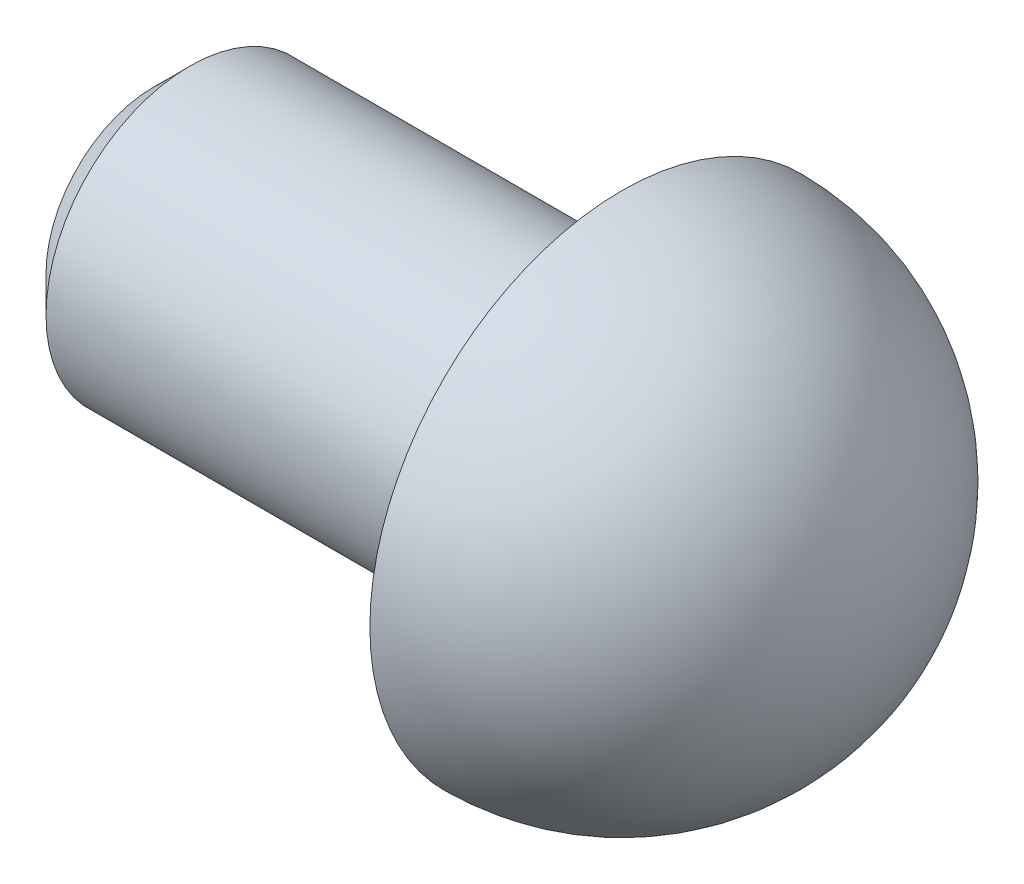
ISO-10303-21;
HEADER;
FILE_DESCRIPTION(('STEP AP214'),'2;1');
FILE_NAME('part.step','',(''),(''),'','','');
FILE_SCHEMA(('AUTOMOTIVE_DESIGN { 1 0 10303 214 1 1 1 1 }'));
ENDSEC;
DATA;
#1=APPLICATION_CONTEXT('core data for automotive mechanical design processes');
#2=APPLICATION_PROTOCOL_DEFINITION('international standard','automotive_design',2000,#1);
#3=PRODUCT_CONTEXT('',#1,'mechanical');
#4=PRODUCT('Part','Part','',(#3));
#5=PRODUCT_RELATED_PRODUCT_CATEGORY('part','',(#4));
#6=PRODUCT_DEFINITION_FORMATION('','',#4);
#7=PRODUCT_DEFINITION_CONTEXT('part definition',#1,'design');
#8=PRODUCT_DEFINITION('design','',#6,#7);
#9=PRODUCT_DEFINITION_SHAPE('','',#8);
#10=(LENGTH_UNIT() NAMED_UNIT(*) SI_UNIT(.MILLI.,.METRE.));
#11=(NAMED_UNIT(*) PLANE_ANGLE_UNIT() SI_UNIT($,.RADIAN.));
#12=(NAMED_UNIT(*) SI_UNIT($,.STERADIAN.) SOLID_ANGLE_UNIT());
#13=UNCERTAINTY_MEASURE_WITH_UNIT(LENGTH_MEASURE(1.E-05),#10,'distance_accuracy_value','');
#14=(GEOMETRIC_REPRESENTATION_CONTEXT(3) GLOBAL_UNCERTAINTY_ASSIGNED_CONTEXT((#13)) GLOBAL_UNIT_ASSIGNED_CONTEXT((#10,
#11,#12)) REPRESENTATION_CONTEXT('',''));
#15=CARTESIAN_POINT('',(0.,0.,0.));
#16=DIRECTION('',(0.,0.,1.));
#17=DIRECTION('',(1.,0.,0.));
#18=AXIS2_PLACEMENT_3D('',#15,#16,#17);
#19=CARTESIAN_POINT('',(0.,0.,0.));
#20=DIRECTION('',(-1.,0.,0.));
#21=DIRECTION('',(0.,1.,0.));
#22=AXIS2_PLACEMENT_3D('',#19,#20,#21);
#23=SPHERICAL_SURFACE('',#22,3.5);
#24=CARTESIAN_POINT('',(0.,0.,0.));
#25=DIRECTION('',(-1.,0.,0.));
#26=DIRECTION('',(0.,0.,1.));
#27=AXIS2_PLACEMENT_3D('',#24,#25,#26);
#28=CIRCLE('',#27,3.5);
#29=CARTESIAN_POINT('',(0.,0.,3.5));
#30=VERTEX_POINT('',#29);
#31=EDGE_CURVE('E45',#30,#30,#28,.T.);
#32=ORIENTED_EDGE('',*,*,#31,.F.);
#33=EDGE_LOOP('',(#32));
#34=FACE_BOUND('',#33,.T.);
#35=ADVANCED_FACE('F33',(#34),#23,.T.);
#36=CARTESIAN_POINT('',(0.,2.,0.));
#37=DIRECTION('',(-1.,0.,0.));
#38=DIRECTION('',(0.,0.,1.));
#39=AXIS2_PLACEMENT_3D('',#36,#37,#38);
#40=PLANE('',#39);
#41=ORIENTED_EDGE('',*,*,#31,.T.);
#42=EDGE_LOOP('',(#41));
#43=FACE_BOUND('',#42,.T.);
#44=CARTESIAN_POINT('',(0.,0.,0.));
#45=DIRECTION('',(-1.,0.,0.));
#46=DIRECTION('',(0.,0.,1.));
#47=AXIS2_PLACEMENT_3D('',#44,#45,#46);
#48=CIRCLE('',#47,2.);
#49=CARTESIAN_POINT('',(0.,0.,2.));
#50=VERTEX_POINT('',#49);
#51=EDGE_CURVE('E49',#50,#50,#48,.T.);
#52=ORIENTED_EDGE('',*,*,#51,.F.);
#53=EDGE_LOOP('',(#52));
#54=FACE_BOUND('',#53,.T.);
#55=ADVANCED_FACE('F57',(#43,#54),#40,.T.);
#56=CARTESIAN_POINT('',(-6.5,0.,0.));
#57=DIRECTION('',(-1.,0.,0.));
#58=DIRECTION('',(0.,0.,1.));
#59=AXIS2_PLACEMENT_3D('',#56,#57,#58);
#60=CYLINDRICAL_SURFACE('',#59,2.);
#61=CARTESIAN_POINT('',(-6.,0.,0.));
#62=DIRECTION('',(-1.,0.,0.));
#63=DIRECTION('',(0.,0.,1.));
#64=AXIS2_PLACEMENT_3D('',#61,#62,#63);
#65=CIRCLE('',#64,2.);
#66=CARTESIAN_POINT('',(-6.,0.,2.));
#67=VERTEX_POINT('',#66);
#68=EDGE_CURVE('E10',#67,#67,#65,.F.);
#69=ORIENTED_EDGE('',*,*,#68,.T.);
#70=EDGE_LOOP('',(#69));
#71=FACE_BOUND('',#70,.T.);
#72=ORIENTED_EDGE('',*,*,#51,.T.);
#73=EDGE_LOOP('',(#72));
#74=FACE_BOUND('',#73,.T.);
#75=ADVANCED_FACE('F55',(#71,#74),#60,.T.);
#76=CARTESIAN_POINT('',(-6.5,0.,0.));
#77=DIRECTION('',(-1.,0.,0.));
#78=DIRECTION('',(0.,0.,1.));
#79=AXIS2_PLACEMENT_3D('',#76,#77,#78);
#80=PLANE('',#79);
#81=CARTESIAN_POINT('',(-6.5,0.,0.));
#82=DIRECTION('',(-1.,0.,0.));
#83=DIRECTION('',(0.,0.,1.));
#84=AXIS2_PLACEMENT_3D('',#81,#82,#83);
#85=CIRCLE('',#84,1.5);
#86=CARTESIAN_POINT('',(-6.5,0.,1.5));
#87=VERTEX_POINT('',#86);
#88=EDGE_CURVE('E41',#87,#87,#85,.T.);
#89=ORIENTED_EDGE('',*,*,#88,.T.);
#90=EDGE_LOOP('',(#89));
#91=FACE_BOUND('',#90,.T.);
#92=ADVANCED_FACE('F65',(#91),#80,.T.);
#93=CARTESIAN_POINT('',(-6.5,0.,0.));
#94=DIRECTION('',(1.,0.,0.));
#95=DIRECTION('',(0.,0.,-1.));
#96=AXIS2_PLACEMENT_3D('',#93,#94,#95);
#97=CONICAL_SURFACE('',#96,1.5,0.785398163397446);
#98=ORIENTED_EDGE('',*,*,#68,.F.);
#99=EDGE_LOOP('',(#98));
#100=FACE_BOUND('',#99,.T.);
#101=ORIENTED_EDGE('',*,*,#88,.F.);
#102=EDGE_LOOP('',(#101));
#103=FACE_BOUND('',#102,.T.);
#104=ADVANCED_FACE('F36',(#100,#103),#97,.T.);
#105=CLOSED_SHELL('',(#35,#55,#75,#92,#104));
#106=MANIFOLD_SOLID_BREP('B2',#105);
#107=ADVANCED_BREP_SHAPE_REPRESENTATION('',(#18,#106),#14);
#108=SHAPE_DEFINITION_REPRESENTATION(#9,#107);
ENDSEC;
END-ISO-10303-21;
